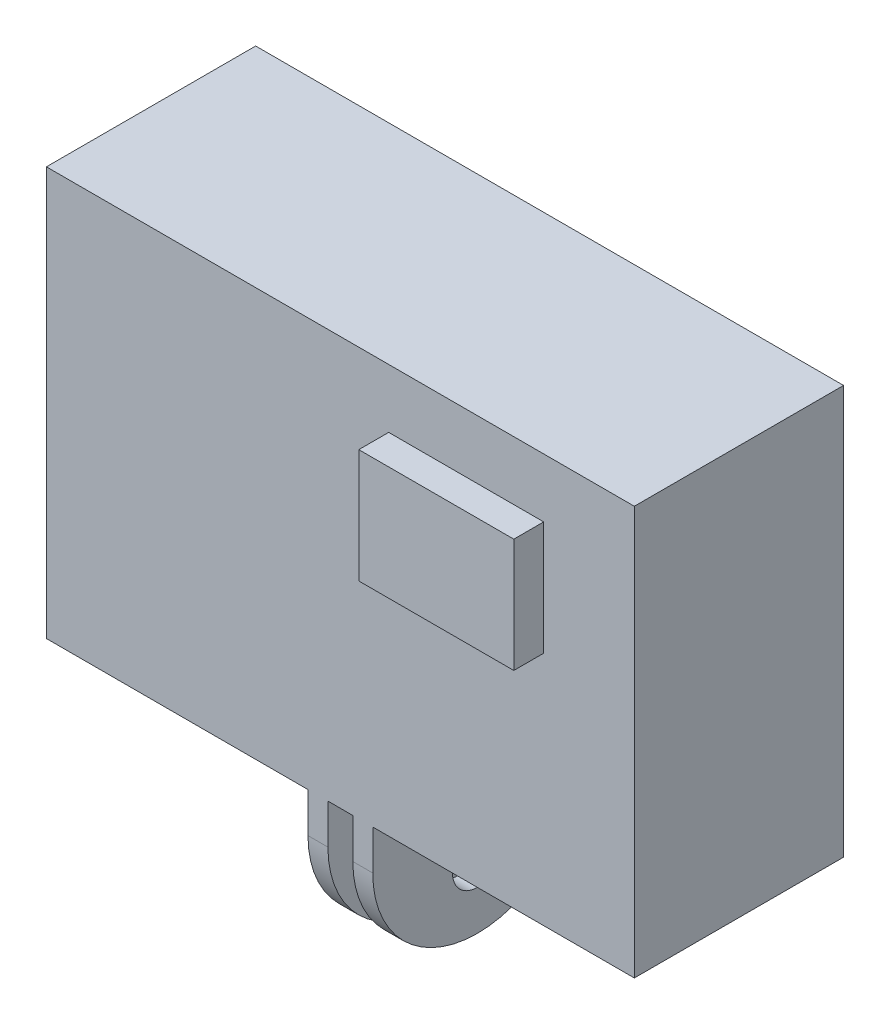
ISO-10303-21;
HEADER;
FILE_DESCRIPTION(('STEP AP214'),'2;1');
FILE_NAME('part.step','',(''),(''),'','','');
FILE_SCHEMA(('AUTOMOTIVE_DESIGN { 1 0 10303 214 1 1 1 1 }'));
ENDSEC;
DATA;
#1=APPLICATION_CONTEXT('core data for automotive mechanical design processes');
#2=APPLICATION_PROTOCOL_DEFINITION('international standard','automotive_design',2000,#1);
#3=PRODUCT_CONTEXT('',#1,'mechanical');
#4=PRODUCT('Part','Part','',(#3));
#5=PRODUCT_RELATED_PRODUCT_CATEGORY('part','',(#4));
#6=PRODUCT_DEFINITION_FORMATION('','',#4);
#7=PRODUCT_DEFINITION_CONTEXT('part definition',#1,'design');
#8=PRODUCT_DEFINITION('design','',#6,#7);
#9=PRODUCT_DEFINITION_SHAPE('','',#8);
#10=(LENGTH_UNIT() NAMED_UNIT(*) SI_UNIT(.MILLI.,.METRE.));
#11=(NAMED_UNIT(*) PLANE_ANGLE_UNIT() SI_UNIT($,.RADIAN.));
#12=(NAMED_UNIT(*) SI_UNIT($,.STERADIAN.) SOLID_ANGLE_UNIT());
#13=UNCERTAINTY_MEASURE_WITH_UNIT(LENGTH_MEASURE(1.E-05),#10,'distance_accuracy_value','');
#14=(GEOMETRIC_REPRESENTATION_CONTEXT(3) GLOBAL_UNCERTAINTY_ASSIGNED_CONTEXT((#13)) GLOBAL_UNIT_ASSIGNED_CONTEXT((#10,
#11,#12)) REPRESENTATION_CONTEXT('',''));
#15=CARTESIAN_POINT('',(0.,0.,0.));
#16=DIRECTION('',(0.,0.,1.));
#17=DIRECTION('',(1.,0.,0.));
#18=AXIS2_PLACEMENT_3D('',#15,#16,#17);
#19=CARTESIAN_POINT('',(-1.25,0.,10.5));
#20=DIRECTION('',(0.,0.,1.));
#21=DIRECTION('',(1.,0.,0.));
#22=AXIS2_PLACEMENT_3D('',#19,#20,#21);
#23=PLANE('',#22);
#24=DIRECTION('',(0.,1.,0.));
#25=VECTOR('',#24,1.);
#26=CARTESIAN_POINT('',(3.25,0.,10.5));
#27=LINE('',#26,#25);
#28=CARTESIAN_POINT('',(3.25,-4.,10.5));
#29=VERTEX_POINT('',#28);
#30=CARTESIAN_POINT('',(3.25,0.,10.5));
#31=VERTEX_POINT('',#30);
#32=EDGE_CURVE('E44',#29,#31,#27,.T.);
#33=ORIENTED_EDGE('',*,*,#32,.T.);
#34=DIRECTION('',(1.,0.,0.));
#35=VECTOR('',#34,1.);
#36=CARTESIAN_POINT('',(-1.25,0.,10.5));
#37=LINE('',#36,#35);
#38=CARTESIAN_POINT('',(29.5,0.,10.5));
#39=VERTEX_POINT('',#38);
#40=EDGE_CURVE('E11',#31,#39,#37,.T.);
#41=ORIENTED_EDGE('',*,*,#40,.T.);
#42=DIRECTION('',(0.,1.,0.));
#43=VECTOR('',#42,1.);
#44=CARTESIAN_POINT('',(29.5,0.,10.5));
#45=LINE('',#44,#43);
#46=CARTESIAN_POINT('',(29.5,41.,10.5));
#47=VERTEX_POINT('',#46);
#48=EDGE_CURVE('E221',#39,#47,#45,.T.);
#49=ORIENTED_EDGE('',*,*,#48,.T.);
#50=DIRECTION('',(1.,0.,0.));
#51=VECTOR('',#50,1.);
#52=CARTESIAN_POINT('',(-1.25,41.,10.5));
#53=LINE('',#52,#51);
#54=CARTESIAN_POINT('',(-29.5,41.,10.5));
#55=VERTEX_POINT('',#54);
#56=EDGE_CURVE('E224',#47,#55,#53,.F.);
#57=ORIENTED_EDGE('',*,*,#56,.T.);
#58=DIRECTION('',(0.,1.,0.));
#59=VECTOR('',#58,1.);
#60=CARTESIAN_POINT('',(-29.5,0.,10.5));
#61=LINE('',#60,#59);
#62=CARTESIAN_POINT('',(-29.5,0.,10.5));
#63=VERTEX_POINT('',#62);
#64=EDGE_CURVE('E233',#55,#63,#61,.F.);
#65=ORIENTED_EDGE('',*,*,#64,.T.);
#66=DIRECTION('',(1.,0.,0.));
#67=VECTOR('',#66,1.);
#68=CARTESIAN_POINT('',(-1.25,0.,10.5));
#69=LINE('',#68,#67);
#70=CARTESIAN_POINT('',(-3.25,0.,10.5));
#71=VERTEX_POINT('',#70);
#72=EDGE_CURVE('E242',#63,#71,#69,.T.);
#73=ORIENTED_EDGE('',*,*,#72,.T.);
#74=DIRECTION('',(0.,1.,0.));
#75=VECTOR('',#74,1.);
#76=CARTESIAN_POINT('',(-3.25,0.,10.5));
#77=LINE('',#76,#75);
#78=CARTESIAN_POINT('',(-3.25,-4.,10.5));
#79=VERTEX_POINT('',#78);
#80=EDGE_CURVE('E251',#71,#79,#77,.F.);
#81=ORIENTED_EDGE('',*,*,#80,.T.);
#82=DIRECTION('',(1.,0.,0.));
#83=VECTOR('',#82,1.);
#84=CARTESIAN_POINT('',(-1.25,-4.,10.5));
#85=LINE('',#84,#83);
#86=CARTESIAN_POINT('',(-1.25,-4.,10.5));
#87=VERTEX_POINT('',#86);
#88=EDGE_CURVE('E160',#79,#87,#85,.T.);
#89=ORIENTED_EDGE('',*,*,#88,.T.);
#90=DIRECTION('',(0.,1.,0.));
#91=VECTOR('',#90,1.);
#92=CARTESIAN_POINT('',(-1.25,0.,10.5));
#93=LINE('',#92,#91);
#94=CARTESIAN_POINT('',(-1.25,0.,10.5));
#95=VERTEX_POINT('',#94);
#96=EDGE_CURVE('E261',#87,#95,#93,.T.);
#97=ORIENTED_EDGE('',*,*,#96,.T.);
#98=DIRECTION('',(1.,0.,0.));
#99=VECTOR('',#98,1.);
#100=CARTESIAN_POINT('',(-1.25,0.,10.5));
#101=LINE('',#100,#99);
#102=CARTESIAN_POINT('',(1.25,0.,10.5));
#103=VERTEX_POINT('',#102);
#104=EDGE_CURVE('E269',#95,#103,#101,.T.);
#105=ORIENTED_EDGE('',*,*,#104,.T.);
#106=DIRECTION('',(0.,1.,0.));
#107=VECTOR('',#106,1.);
#108=CARTESIAN_POINT('',(1.25,0.,10.5));
#109=LINE('',#108,#107);
#110=CARTESIAN_POINT('',(1.25,-4.,10.5));
#111=VERTEX_POINT('',#110);
#112=EDGE_CURVE('E279',#103,#111,#109,.F.);
#113=ORIENTED_EDGE('',*,*,#112,.T.);
#114=DIRECTION('',(1.,0.,0.));
#115=VECTOR('',#114,1.);
#116=CARTESIAN_POINT('',(-1.25,-4.,10.5));
#117=LINE('',#116,#115);
#118=EDGE_CURVE('E290',#111,#29,#117,.T.);
#119=ORIENTED_EDGE('',*,*,#118,.T.);
#120=EDGE_LOOP('',(#33,#41,#49,#57,#65,#73,#81,#89,#97,#105,#113,#119));
#121=FACE_BOUND('',#120,.T.);
#122=DIRECTION('',(1.,0.,0.));
#123=VECTOR('',#122,1.);
#124=CARTESIAN_POINT('',(4.84860398685466,23.6796007397109,10.5));
#125=LINE('',#124,#123);
#126=CARTESIAN_POINT('',(4.84860398685466,23.6796007397109,10.5));
#127=VERTEX_POINT('',#126);
#128=CARTESIAN_POINT('',(20.4045417780133,23.6796007397109,10.5));
#129=VERTEX_POINT('',#128);
#130=EDGE_CURVE('E320',#127,#129,#125,.T.);
#131=ORIENTED_EDGE('',*,*,#130,.F.);
#132=DIRECTION('',(0.,-1.,0.));
#133=VECTOR('',#132,1.);
#134=CARTESIAN_POINT('',(4.84860398685466,35.0940226254312,10.5));
#135=LINE('',#134,#133);
#136=CARTESIAN_POINT('',(4.84860398685466,35.0940226254312,10.5));
#137=VERTEX_POINT('',#136);
#138=EDGE_CURVE('E323',#137,#127,#135,.T.);
#139=ORIENTED_EDGE('',*,*,#138,.F.);
#140=DIRECTION('',(-1.,0.,0.));
#141=VECTOR('',#140,1.);
#142=CARTESIAN_POINT('',(4.84860398685466,35.0940226254312,10.5));
#143=LINE('',#142,#141);
#144=CARTESIAN_POINT('',(20.4045417780133,35.0940226254312,10.5));
#145=VERTEX_POINT('',#144);
#146=EDGE_CURVE('E315',#145,#137,#143,.T.);
#147=ORIENTED_EDGE('',*,*,#146,.F.);
#148=DIRECTION('',(0.,1.,0.));
#149=VECTOR('',#148,1.);
#150=CARTESIAN_POINT('',(20.4045417780133,35.0940226254312,10.5));
#151=LINE('',#150,#149);
#152=EDGE_CURVE('E318',#129,#145,#151,.T.);
#153=ORIENTED_EDGE('',*,*,#152,.F.);
#154=EDGE_LOOP('',(#131,#139,#147,#153));
#155=FACE_BOUND('',#154,.T.);
#156=ADVANCED_FACE('F35',(#121,#155),#23,.T.);
#157=CARTESIAN_POINT('',(-1.25,-8.,0.));
#158=DIRECTION('',(-1.,0.,0.));
#159=DIRECTION('',(0.,0.,1.));
#160=AXIS2_PLACEMENT_3D('',#157,#158,#159);
#161=CYLINDRICAL_SURFACE('',#160,2.5);
#162=CARTESIAN_POINT('',(-3.25,-8.,0.));
#163=DIRECTION('',(-1.,0.,0.));
#164=DIRECTION('',(0.,0.,1.));
#165=AXIS2_PLACEMENT_3D('',#162,#163,#164);
#166=CIRCLE('',#165,2.5);
#167=CARTESIAN_POINT('',(-3.25,-8.,2.5));
#168=VERTEX_POINT('',#167);
#169=EDGE_CURVE('E39',#168,#168,#166,.T.);
#170=ORIENTED_EDGE('',*,*,#169,.T.);
#171=EDGE_LOOP('',(#170));
#172=FACE_BOUND('',#171,.T.);
#173=CARTESIAN_POINT('',(-1.25,-8.,0.));
#174=DIRECTION('',(-1.,0.,0.));
#175=DIRECTION('',(0.,0.,1.));
#176=AXIS2_PLACEMENT_3D('',#173,#174,#175);
#177=CIRCLE('',#176,2.5);
#178=CARTESIAN_POINT('',(-1.25,-8.,2.5));
#179=VERTEX_POINT('',#178);
#180=EDGE_CURVE('E165',#179,#179,#177,.T.);
#181=ORIENTED_EDGE('',*,*,#180,.F.);
#182=EDGE_LOOP('',(#181));
#183=FACE_BOUND('',#182,.T.);
#184=ADVANCED_FACE('F37',(#172,#183),#161,.F.);
#185=CARTESIAN_POINT('',(1.25,-8.,0.));
#186=DIRECTION('',(-1.,0.,0.));
#187=DIRECTION('',(0.,0.,1.));
#188=AXIS2_PLACEMENT_3D('',#185,#186,#187);
#189=CYLINDRICAL_SURFACE('',#188,2.5);
#190=CARTESIAN_POINT('',(3.25,-8.,0.));
#191=DIRECTION('',(-1.,0.,0.));
#192=DIRECTION('',(0.,0.,1.));
#193=AXIS2_PLACEMENT_3D('',#190,#191,#192);
#194=CIRCLE('',#193,2.5);
#195=CARTESIAN_POINT('',(3.25,-8.,2.5));
#196=VERTEX_POINT('',#195);
#197=EDGE_CURVE('E181',#196,#196,#194,.T.);
#198=ORIENTED_EDGE('',*,*,#197,.F.);
#199=EDGE_LOOP('',(#198));
#200=FACE_BOUND('',#199,.T.);
#201=CARTESIAN_POINT('',(1.25,-8.,0.));
#202=DIRECTION('',(-1.,0.,0.));
#203=DIRECTION('',(0.,0.,1.));
#204=AXIS2_PLACEMENT_3D('',#201,#202,#203);
#205=CIRCLE('',#204,2.5);
#206=CARTESIAN_POINT('',(1.25,-8.,2.5));
#207=VERTEX_POINT('',#206);
#208=EDGE_CURVE('E169',#207,#207,#205,.T.);
#209=ORIENTED_EDGE('',*,*,#208,.T.);
#210=EDGE_LOOP('',(#209));
#211=FACE_BOUND('',#210,.T.);
#212=ADVANCED_FACE('F372',(#200,#211),#189,.F.);
#213=CARTESIAN_POINT('',(-1.25,-4.,-10.5));
#214=DIRECTION('',(0.,0.,-1.));
#215=DIRECTION('',(-1.,0.,0.));
#216=AXIS2_PLACEMENT_3D('',#213,#214,#215);
#217=PLANE('',#216);
#218=DIRECTION('',(0.,1.,0.));
#219=VECTOR('',#218,1.);
#220=CARTESIAN_POINT('',(1.25,0.,-10.5));
#221=LINE('',#220,#219);
#222=CARTESIAN_POINT('',(1.25,-4.,-10.5));
#223=VERTEX_POINT('',#222);
#224=CARTESIAN_POINT('',(1.25,0.,-10.5));
#225=VERTEX_POINT('',#224);
#226=EDGE_CURVE('E173',#223,#225,#221,.T.);
#227=ORIENTED_EDGE('',*,*,#226,.T.);
#228=DIRECTION('',(1.,0.,0.));
#229=VECTOR('',#228,1.);
#230=CARTESIAN_POINT('',(-29.5,0.,-10.5));
#231=LINE('',#230,#229);
#232=CARTESIAN_POINT('',(-1.25,0.,-10.5));
#233=VERTEX_POINT('',#232);
#234=EDGE_CURVE('E168',#233,#225,#231,.T.);
#235=ORIENTED_EDGE('',*,*,#234,.F.);
#236=DIRECTION('',(0.,1.,0.));
#237=VECTOR('',#236,1.);
#238=CARTESIAN_POINT('',(-1.25,0.,-10.5));
#239=LINE('',#238,#237);
#240=CARTESIAN_POINT('',(-1.25,-4.,-10.5));
#241=VERTEX_POINT('',#240);
#242=EDGE_CURVE('E153',#241,#233,#239,.T.);
#243=ORIENTED_EDGE('',*,*,#242,.F.);
#244=DIRECTION('',(1.,0.,0.));
#245=VECTOR('',#244,1.);
#246=CARTESIAN_POINT('',(-1.25,-4.,-10.5));
#247=LINE('',#246,#245);
#248=CARTESIAN_POINT('',(-3.25,-4.,-10.5));
#249=VERTEX_POINT('',#248);
#250=EDGE_CURVE('E149',#249,#241,#247,.T.);
#251=ORIENTED_EDGE('',*,*,#250,.F.);
#252=DIRECTION('',(0.,1.,0.));
#253=VECTOR('',#252,1.);
#254=CARTESIAN_POINT('',(-3.25,0.,-10.5));
#255=LINE('',#254,#253);
#256=CARTESIAN_POINT('',(-3.25,0.,-10.5));
#257=VERTEX_POINT('',#256);
#258=EDGE_CURVE('E137',#249,#257,#255,.T.);
#259=ORIENTED_EDGE('',*,*,#258,.T.);
#260=DIRECTION('',(1.,0.,0.));
#261=VECTOR('',#260,1.);
#262=CARTESIAN_POINT('',(-29.5,0.,-10.5));
#263=LINE('',#262,#261);
#264=CARTESIAN_POINT('',(-29.5,0.,-10.5));
#265=VERTEX_POINT('',#264);
#266=EDGE_CURVE('E198',#265,#257,#263,.T.);
#267=ORIENTED_EDGE('',*,*,#266,.F.);
#268=DIRECTION('',(0.,1.,0.));
#269=VECTOR('',#268,1.);
#270=CARTESIAN_POINT('',(-29.5,41.,-10.5));
#271=LINE('',#270,#269);
#272=CARTESIAN_POINT('',(-29.5,41.,-10.5));
#273=VERTEX_POINT('',#272);
#274=EDGE_CURVE('E193',#273,#265,#271,.F.);
#275=ORIENTED_EDGE('',*,*,#274,.F.);
#276=DIRECTION('',(1.,0.,0.));
#277=VECTOR('',#276,1.);
#278=CARTESIAN_POINT('',(29.5,41.,-10.5));
#279=LINE('',#278,#277);
#280=CARTESIAN_POINT('',(29.5,41.,-10.5));
#281=VERTEX_POINT('',#280);
#282=EDGE_CURVE('E187',#281,#273,#279,.F.);
#283=ORIENTED_EDGE('',*,*,#282,.F.);
#284=DIRECTION('',(0.,1.,0.));
#285=VECTOR('',#284,1.);
#286=CARTESIAN_POINT('',(29.5,0.,-10.5));
#287=LINE('',#286,#285);
#288=CARTESIAN_POINT('',(29.5,0.,-10.5));
#289=VERTEX_POINT('',#288);
#290=EDGE_CURVE('E207',#289,#281,#287,.T.);
#291=ORIENTED_EDGE('',*,*,#290,.F.);
#292=DIRECTION('',(1.,0.,0.));
#293=VECTOR('',#292,1.);
#294=CARTESIAN_POINT('',(-29.5,0.,-10.5));
#295=LINE('',#294,#293);
#296=CARTESIAN_POINT('',(3.25,0.,-10.5));
#297=VERTEX_POINT('',#296);
#298=EDGE_CURVE('E184',#297,#289,#295,.T.);
#299=ORIENTED_EDGE('',*,*,#298,.F.);
#300=DIRECTION('',(0.,1.,0.));
#301=VECTOR('',#300,1.);
#302=CARTESIAN_POINT('',(3.25,0.,-10.5));
#303=LINE('',#302,#301);
#304=CARTESIAN_POINT('',(3.25,-4.,-10.5));
#305=VERTEX_POINT('',#304);
#306=EDGE_CURVE('E180',#305,#297,#303,.T.);
#307=ORIENTED_EDGE('',*,*,#306,.F.);
#308=DIRECTION('',(1.,0.,0.));
#309=VECTOR('',#308,1.);
#310=CARTESIAN_POINT('',(1.25,-4.,-10.5));
#311=LINE('',#310,#309);
#312=EDGE_CURVE('E172',#223,#305,#311,.T.);
#313=ORIENTED_EDGE('',*,*,#312,.F.);
#314=EDGE_LOOP('',(#227,#235,#243,#251,#259,#267,#275,#283,#291,#299,#307,#313));
#315=FACE_BOUND('',#314,.T.);
#316=ADVANCED_FACE('F151',(#315),#217,.T.);
#317=CARTESIAN_POINT('',(29.5,0.,-10.5));
#318=DIRECTION('',(1.,0.,0.));
#319=DIRECTION('',(0.,0.,-1.));
#320=AXIS2_PLACEMENT_3D('',#317,#318,#319);
#321=PLANE('',#320);
#322=DIRECTION('',(0.,0.,-1.));
#323=VECTOR('',#322,1.);
#324=CARTESIAN_POINT('',(29.5,0.,-10.5));
#325=LINE('',#324,#323);
#326=EDGE_CURVE('E214',#289,#39,#325,.F.);
#327=ORIENTED_EDGE('',*,*,#326,.F.);
#328=ORIENTED_EDGE('',*,*,#290,.T.);
#329=DIRECTION('',(0.,0.,1.));
#330=VECTOR('',#329,1.);
#331=CARTESIAN_POINT('',(29.5,41.,-10.5));
#332=LINE('',#331,#330);
#333=EDGE_CURVE('E190',#47,#281,#332,.F.);
#334=ORIENTED_EDGE('',*,*,#333,.F.);
#335=ORIENTED_EDGE('',*,*,#48,.F.);
#336=EDGE_LOOP('',(#327,#328,#334,#335));
#337=FACE_BOUND('',#336,.T.);
#338=ADVANCED_FACE('F418',(#337),#321,.T.);
#339=CARTESIAN_POINT('',(29.5,41.,-10.5));
#340=DIRECTION('',(0.,1.,0.));
#341=DIRECTION('',(0.,0.,1.));
#342=AXIS2_PLACEMENT_3D('',#339,#340,#341);
#343=PLANE('',#342);
#344=ORIENTED_EDGE('',*,*,#333,.T.);
#345=ORIENTED_EDGE('',*,*,#282,.T.);
#346=DIRECTION('',(0.,0.,1.));
#347=VECTOR('',#346,1.);
#348=CARTESIAN_POINT('',(-29.5,41.,-10.5));
#349=LINE('',#348,#347);
#350=EDGE_CURVE('E189',#55,#273,#349,.F.);
#351=ORIENTED_EDGE('',*,*,#350,.F.);
#352=ORIENTED_EDGE('',*,*,#56,.F.);
#353=EDGE_LOOP('',(#344,#345,#351,#352));
#354=FACE_BOUND('',#353,.T.);
#355=ADVANCED_FACE('F414',(#354),#343,.T.);
#356=CARTESIAN_POINT('',(-29.5,41.,-10.5));
#357=DIRECTION('',(-1.,0.,0.));
#358=DIRECTION('',(0.,0.,1.));
#359=AXIS2_PLACEMENT_3D('',#356,#357,#358);
#360=PLANE('',#359);
#361=ORIENTED_EDGE('',*,*,#350,.T.);
#362=ORIENTED_EDGE('',*,*,#274,.T.);
#363=DIRECTION('',(0.,0.,-1.));
#364=VECTOR('',#363,1.);
#365=CARTESIAN_POINT('',(-29.5,0.,-10.5));
#366=LINE('',#365,#364);
#367=EDGE_CURVE('E195',#63,#265,#366,.T.);
#368=ORIENTED_EDGE('',*,*,#367,.F.);
#369=ORIENTED_EDGE('',*,*,#64,.F.);
#370=EDGE_LOOP('',(#361,#362,#368,#369));
#371=FACE_BOUND('',#370,.T.);
#372=ADVANCED_FACE('F410',(#371),#360,.T.);
#373=CARTESIAN_POINT('',(-29.5,0.,-10.5));
#374=DIRECTION('',(0.,-1.,0.));
#375=DIRECTION('',(0.,0.,-1.));
#376=AXIS2_PLACEMENT_3D('',#373,#374,#375);
#377=PLANE('',#376);
#378=ORIENTED_EDGE('',*,*,#266,.T.);
#379=DIRECTION('',(0.,0.,-1.));
#380=VECTOR('',#379,1.);
#381=CARTESIAN_POINT('',(-3.25,0.,0.));
#382=LINE('',#381,#380);
#383=EDGE_CURVE('E144',#257,#71,#382,.F.);
#384=ORIENTED_EDGE('',*,*,#383,.T.);
#385=ORIENTED_EDGE('',*,*,#72,.F.);
#386=ORIENTED_EDGE('',*,*,#367,.T.);
#387=EDGE_LOOP('',(#378,#384,#385,#386));
#388=FACE_BOUND('',#387,.T.);
#389=ADVANCED_FACE('F406',(#388),#377,.T.);
#390=CARTESIAN_POINT('',(-3.25,0.,0.));
#391=DIRECTION('',(1.,0.,0.));
#392=DIRECTION('',(0.,0.,-1.));
#393=AXIS2_PLACEMENT_3D('',#390,#391,#392);
#394=PLANE('',#393);
#395=ORIENTED_EDGE('',*,*,#169,.F.);
#396=EDGE_LOOP('',(#395));
#397=FACE_BOUND('',#396,.T.);
#398=CARTESIAN_POINT('',(-3.25,-4.,0.));
#399=DIRECTION('',(1.,0.,0.));
#400=DIRECTION('',(0.,0.,-1.));
#401=AXIS2_PLACEMENT_3D('',#398,#399,#400);
#402=CIRCLE('',#401,10.5);
#403=EDGE_CURVE('E142',#79,#249,#402,.T.);
#404=ORIENTED_EDGE('',*,*,#403,.F.);
#405=ORIENTED_EDGE('',*,*,#80,.F.);
#406=ORIENTED_EDGE('',*,*,#383,.F.);
#407=ORIENTED_EDGE('',*,*,#258,.F.);
#408=EDGE_LOOP('',(#404,#405,#406,#407));
#409=FACE_BOUND('',#408,.T.);
#410=ADVANCED_FACE('F139',(#397,#409),#394,.F.);
#411=CARTESIAN_POINT('',(-1.25,-4.,0.));
#412=DIRECTION('',(1.,0.,0.));
#413=DIRECTION('',(0.,0.,-1.));
#414=AXIS2_PLACEMENT_3D('',#411,#412,#413);
#415=CYLINDRICAL_SURFACE('',#414,10.5);
#416=ORIENTED_EDGE('',*,*,#250,.T.);
#417=CARTESIAN_POINT('',(-1.25,-4.,0.));
#418=DIRECTION('',(1.,0.,0.));
#419=DIRECTION('',(0.,0.,-1.));
#420=AXIS2_PLACEMENT_3D('',#417,#418,#419);
#421=CIRCLE('',#420,10.5);
#422=EDGE_CURVE('E156',#87,#241,#421,.T.);
#423=ORIENTED_EDGE('',*,*,#422,.F.);
#424=ORIENTED_EDGE('',*,*,#88,.F.);
#425=ORIENTED_EDGE('',*,*,#403,.T.);
#426=EDGE_LOOP('',(#416,#423,#424,#425));
#427=FACE_BOUND('',#426,.T.);
#428=ADVANCED_FACE('F158',(#427),#415,.T.);
#429=CARTESIAN_POINT('',(-1.25,0.,0.));
#430=DIRECTION('',(1.,0.,0.));
#431=DIRECTION('',(0.,0.,-1.));
#432=AXIS2_PLACEMENT_3D('',#429,#430,#431);
#433=PLANE('',#432);
#434=ORIENTED_EDGE('',*,*,#180,.T.);
#435=EDGE_LOOP('',(#434));
#436=FACE_BOUND('',#435,.T.);
#437=ORIENTED_EDGE('',*,*,#242,.T.);
#438=DIRECTION('',(0.,0.,-1.));
#439=VECTOR('',#438,1.);
#440=CARTESIAN_POINT('',(-1.25,0.,-10.5));
#441=LINE('',#440,#439);
#442=EDGE_CURVE('E203',#95,#233,#441,.T.);
#443=ORIENTED_EDGE('',*,*,#442,.F.);
#444=ORIENTED_EDGE('',*,*,#96,.F.);
#445=ORIENTED_EDGE('',*,*,#422,.T.);
#446=EDGE_LOOP('',(#437,#443,#444,#445));
#447=FACE_BOUND('',#446,.T.);
#448=ADVANCED_FACE('F397',(#436,#447),#433,.T.);
#449=CARTESIAN_POINT('',(-29.5,0.,-10.5));
#450=DIRECTION('',(0.,-1.,0.));
#451=DIRECTION('',(0.,0.,-1.));
#452=AXIS2_PLACEMENT_3D('',#449,#450,#451);
#453=PLANE('',#452);
#454=ORIENTED_EDGE('',*,*,#104,.F.);
#455=ORIENTED_EDGE('',*,*,#442,.T.);
#456=ORIENTED_EDGE('',*,*,#234,.T.);
#457=DIRECTION('',(0.,0.,-1.));
#458=VECTOR('',#457,1.);
#459=CARTESIAN_POINT('',(1.25,0.,0.));
#460=LINE('',#459,#458);
#461=EDGE_CURVE('E274',#225,#103,#460,.F.);
#462=ORIENTED_EDGE('',*,*,#461,.T.);
#463=EDGE_LOOP('',(#454,#455,#456,#462));
#464=FACE_BOUND('',#463,.T.);
#465=ADVANCED_FACE('F393',(#464),#453,.T.);
#466=CARTESIAN_POINT('',(1.25,0.,0.));
#467=DIRECTION('',(1.,0.,0.));
#468=DIRECTION('',(0.,0.,-1.));
#469=AXIS2_PLACEMENT_3D('',#466,#467,#468);
#470=PLANE('',#469);
#471=ORIENTED_EDGE('',*,*,#208,.F.);
#472=EDGE_LOOP('',(#471));
#473=FACE_BOUND('',#472,.T.);
#474=CARTESIAN_POINT('',(1.25,-4.,0.));
#475=DIRECTION('',(1.,0.,0.));
#476=DIRECTION('',(0.,0.,-1.));
#477=AXIS2_PLACEMENT_3D('',#474,#475,#476);
#478=CIRCLE('',#477,10.5);
#479=EDGE_CURVE('E174',#111,#223,#478,.T.);
#480=ORIENTED_EDGE('',*,*,#479,.F.);
#481=ORIENTED_EDGE('',*,*,#112,.F.);
#482=ORIENTED_EDGE('',*,*,#461,.F.);
#483=ORIENTED_EDGE('',*,*,#226,.F.);
#484=EDGE_LOOP('',(#480,#481,#482,#483));
#485=FACE_BOUND('',#484,.T.);
#486=ADVANCED_FACE('F389',(#473,#485),#470,.F.);
#487=CARTESIAN_POINT('',(1.25,-4.,0.));
#488=DIRECTION('',(1.,0.,0.));
#489=DIRECTION('',(0.,0.,-1.));
#490=AXIS2_PLACEMENT_3D('',#487,#488,#489);
#491=CYLINDRICAL_SURFACE('',#490,10.5);
#492=ORIENTED_EDGE('',*,*,#118,.F.);
#493=ORIENTED_EDGE('',*,*,#479,.T.);
#494=ORIENTED_EDGE('',*,*,#312,.T.);
#495=CARTESIAN_POINT('',(3.25,-4.,0.));
#496=DIRECTION('',(1.,0.,0.));
#497=DIRECTION('',(0.,0.,-1.));
#498=AXIS2_PLACEMENT_3D('',#495,#496,#497);
#499=CIRCLE('',#498,10.5);
#500=EDGE_CURVE('E177',#29,#305,#499,.T.);
#501=ORIENTED_EDGE('',*,*,#500,.F.);
#502=EDGE_LOOP('',(#492,#493,#494,#501));
#503=FACE_BOUND('',#502,.T.);
#504=ADVANCED_FACE('F383',(#503),#491,.T.);
#505=CARTESIAN_POINT('',(3.25,0.,0.));
#506=DIRECTION('',(1.,0.,0.));
#507=DIRECTION('',(0.,0.,-1.));
#508=AXIS2_PLACEMENT_3D('',#505,#506,#507);
#509=PLANE('',#508);
#510=ORIENTED_EDGE('',*,*,#197,.T.);
#511=EDGE_LOOP('',(#510));
#512=FACE_BOUND('',#511,.T.);
#513=ORIENTED_EDGE('',*,*,#306,.T.);
#514=DIRECTION('',(0.,0.,-1.));
#515=VECTOR('',#514,1.);
#516=CARTESIAN_POINT('',(3.25,0.,-10.5));
#517=LINE('',#516,#515);
#518=EDGE_CURVE('E61',#31,#297,#517,.T.);
#519=ORIENTED_EDGE('',*,*,#518,.F.);
#520=ORIENTED_EDGE('',*,*,#32,.F.);
#521=ORIENTED_EDGE('',*,*,#500,.T.);
#522=EDGE_LOOP('',(#513,#519,#520,#521));
#523=FACE_BOUND('',#522,.T.);
#524=ADVANCED_FACE('F377',(#512,#523),#509,.T.);
#525=CARTESIAN_POINT('',(-29.5,0.,-10.5));
#526=DIRECTION('',(0.,-1.,0.));
#527=DIRECTION('',(0.,0.,-1.));
#528=AXIS2_PLACEMENT_3D('',#525,#526,#527);
#529=PLANE('',#528);
#530=ORIENTED_EDGE('',*,*,#40,.F.);
#531=ORIENTED_EDGE('',*,*,#518,.T.);
#532=ORIENTED_EDGE('',*,*,#298,.T.);
#533=ORIENTED_EDGE('',*,*,#326,.T.);
#534=EDGE_LOOP('',(#530,#531,#532,#533));
#535=FACE_BOUND('',#534,.T.);
#536=ADVANCED_FACE('F368',(#535),#529,.T.);
#537=CARTESIAN_POINT('',(4.84860398685466,35.0940226254312,13.5));
#538=DIRECTION('',(1.,0.,0.));
#539=DIRECTION('',(0.,0.,-1.));
#540=AXIS2_PLACEMENT_3D('',#537,#538,#539);
#541=PLANE('',#540);
#542=ORIENTED_EDGE('',*,*,#138,.T.);
#543=DIRECTION('',(0.,0.,-1.));
#544=VECTOR('',#543,1.);
#545=CARTESIAN_POINT('',(4.84860398685466,23.6796007397109,13.5));
#546=LINE('',#545,#544);
#547=CARTESIAN_POINT('',(4.84860398685466,23.6796007397109,13.5));
#548=VERTEX_POINT('',#547);
#549=EDGE_CURVE('E209',#548,#127,#546,.T.);
#550=ORIENTED_EDGE('',*,*,#549,.F.);
#551=DIRECTION('',(0.,-1.,0.));
#552=VECTOR('',#551,1.);
#553=CARTESIAN_POINT('',(4.84860398685466,35.0940226254312,13.5));
#554=LINE('',#553,#552);
#555=CARTESIAN_POINT('',(4.84860398685466,35.0940226254312,13.5));
#556=VERTEX_POINT('',#555);
#557=EDGE_CURVE('E317',#556,#548,#554,.T.);
#558=ORIENTED_EDGE('',*,*,#557,.F.);
#559=DIRECTION('',(0.,0.,-1.));
#560=VECTOR('',#559,1.);
#561=CARTESIAN_POINT('',(4.84860398685466,35.0940226254312,13.5));
#562=LINE('',#561,#560);
#563=EDGE_CURVE('E311',#556,#137,#562,.T.);
#564=ORIENTED_EDGE('',*,*,#563,.T.);
#565=EDGE_LOOP('',(#542,#550,#558,#564));
#566=FACE_BOUND('',#565,.T.);
#567=ADVANCED_FACE('F346',(#566),#541,.F.);
#568=CARTESIAN_POINT('',(4.84860398685466,23.6796007397109,13.5));
#569=DIRECTION('',(0.,1.,0.));
#570=DIRECTION('',(0.,0.,1.));
#571=AXIS2_PLACEMENT_3D('',#568,#569,#570);
#572=PLANE('',#571);
#573=ORIENTED_EDGE('',*,*,#130,.T.);
#574=DIRECTION('',(0.,0.,-1.));
#575=VECTOR('',#574,1.);
#576=CARTESIAN_POINT('',(20.4045417780133,23.6796007397109,13.5));
#577=LINE('',#576,#575);
#578=CARTESIAN_POINT('',(20.4045417780133,23.6796007397109,13.5));
#579=VERTEX_POINT('',#578);
#580=EDGE_CURVE('E307',#579,#129,#577,.T.);
#581=ORIENTED_EDGE('',*,*,#580,.F.);
#582=DIRECTION('',(1.,0.,0.));
#583=VECTOR('',#582,1.);
#584=CARTESIAN_POINT('',(4.84860398685466,23.6796007397109,13.5));
#585=LINE('',#584,#583);
#586=EDGE_CURVE('E331',#548,#579,#585,.T.);
#587=ORIENTED_EDGE('',*,*,#586,.F.);
#588=ORIENTED_EDGE('',*,*,#549,.T.);
#589=EDGE_LOOP('',(#573,#581,#587,#588));
#590=FACE_BOUND('',#589,.T.);
#591=ADVANCED_FACE('F351',(#590),#572,.F.);
#592=CARTESIAN_POINT('',(20.4045417780133,35.0940226254312,13.5));
#593=DIRECTION('',(-1.,0.,0.));
#594=DIRECTION('',(0.,0.,1.));
#595=AXIS2_PLACEMENT_3D('',#592,#593,#594);
#596=PLANE('',#595);
#597=ORIENTED_EDGE('',*,*,#152,.T.);
#598=DIRECTION('',(0.,0.,-1.));
#599=VECTOR('',#598,1.);
#600=CARTESIAN_POINT('',(20.4045417780133,35.0940226254312,13.5));
#601=LINE('',#600,#599);
#602=CARTESIAN_POINT('',(20.4045417780133,35.0940226254312,13.5));
#603=VERTEX_POINT('',#602);
#604=EDGE_CURVE('E52',#603,#145,#601,.T.);
#605=ORIENTED_EDGE('',*,*,#604,.F.);
#606=DIRECTION('',(0.,1.,0.));
#607=VECTOR('',#606,1.);
#608=CARTESIAN_POINT('',(20.4045417780133,35.0940226254312,13.5));
#609=LINE('',#608,#607);
#610=EDGE_CURVE('E328',#579,#603,#609,.T.);
#611=ORIENTED_EDGE('',*,*,#610,.F.);
#612=ORIENTED_EDGE('',*,*,#580,.T.);
#613=EDGE_LOOP('',(#597,#605,#611,#612));
#614=FACE_BOUND('',#613,.T.);
#615=ADVANCED_FACE('F360',(#614),#596,.F.);
#616=CARTESIAN_POINT('',(4.84860398685466,35.0940226254312,13.5));
#617=DIRECTION('',(0.,-1.,0.));
#618=DIRECTION('',(0.,0.,-1.));
#619=AXIS2_PLACEMENT_3D('',#616,#617,#618);
#620=PLANE('',#619);
#621=ORIENTED_EDGE('',*,*,#146,.T.);
#622=ORIENTED_EDGE('',*,*,#563,.F.);
#623=DIRECTION('',(-1.,0.,0.));
#624=VECTOR('',#623,1.);
#625=CARTESIAN_POINT('',(4.84860398685466,35.0940226254312,13.5));
#626=LINE('',#625,#624);
#627=EDGE_CURVE('E314',#603,#556,#626,.T.);
#628=ORIENTED_EDGE('',*,*,#627,.F.);
#629=ORIENTED_EDGE('',*,*,#604,.T.);
#630=EDGE_LOOP('',(#621,#622,#628,#629));
#631=FACE_BOUND('',#630,.T.);
#632=ADVANCED_FACE('F363',(#631),#620,.F.);
#633=CARTESIAN_POINT('',(0.,0.,13.5));
#634=DIRECTION('',(0.,0.,1.));
#635=DIRECTION('',(1.,0.,0.));
#636=AXIS2_PLACEMENT_3D('',#633,#634,#635);
#637=PLANE('',#636);
#638=ORIENTED_EDGE('',*,*,#557,.T.);
#639=ORIENTED_EDGE('',*,*,#586,.T.);
#640=ORIENTED_EDGE('',*,*,#610,.T.);
#641=ORIENTED_EDGE('',*,*,#627,.T.);
#642=EDGE_LOOP('',(#638,#639,#640,#641));
#643=FACE_BOUND('',#642,.T.);
#644=ADVANCED_FACE('F339',(#643),#637,.T.);
#645=CLOSED_SHELL('',(#156,#184,#212,#316,#338,#355,#372,#389,#410,#428,#448,#465,#486,#504,
#524,#536,#567,#591,#615,#632,#644));
#646=MANIFOLD_SOLID_BREP('B2',#645);
#647=ADVANCED_BREP_SHAPE_REPRESENTATION('',(#18,#646),#14);
#648=SHAPE_DEFINITION_REPRESENTATION(#9,#647);
ENDSEC;
END-ISO-10303-21;
